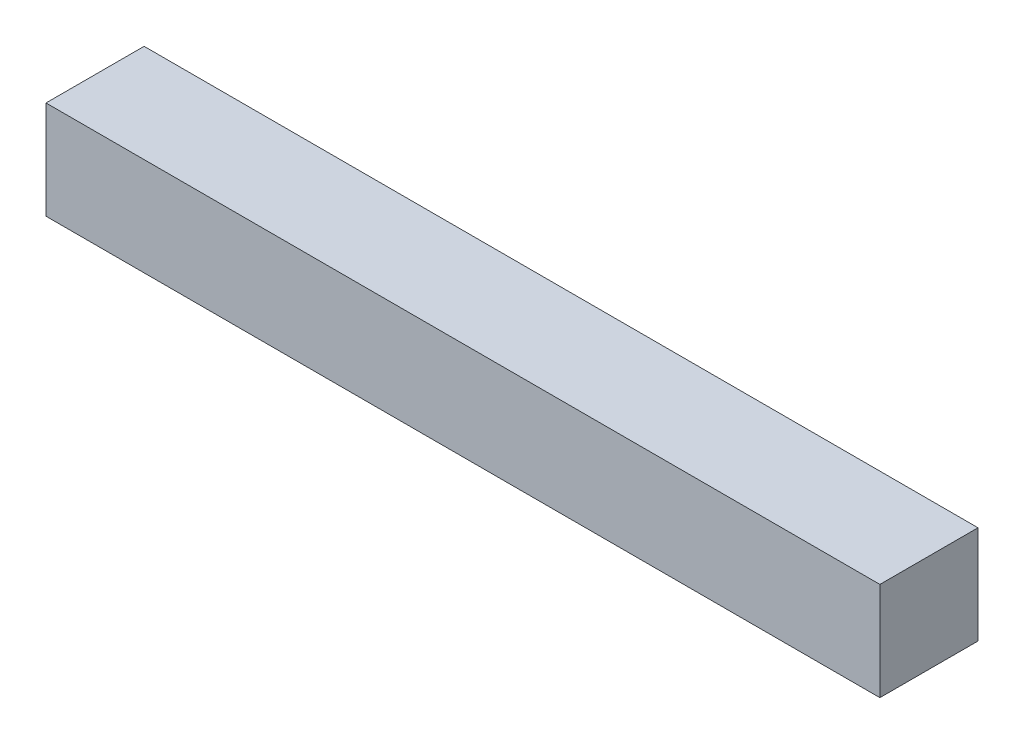
ISO-10303-21;
HEADER;
FILE_DESCRIPTION(('STEP AP214'),'2;1');
FILE_NAME('part.step','',(''),(''),'','','');
FILE_SCHEMA(('AUTOMOTIVE_DESIGN { 1 0 10303 214 1 1 1 1 }'));
ENDSEC;
DATA;
#1=APPLICATION_CONTEXT('core data for automotive mechanical design processes');
#2=APPLICATION_PROTOCOL_DEFINITION('international standard','automotive_design',2000,#1);
#3=PRODUCT_CONTEXT('',#1,'mechanical');
#4=PRODUCT('Part','Part','',(#3));
#5=PRODUCT_RELATED_PRODUCT_CATEGORY('part','',(#4));
#6=PRODUCT_DEFINITION_FORMATION('','',#4);
#7=PRODUCT_DEFINITION_CONTEXT('part definition',#1,'design');
#8=PRODUCT_DEFINITION('design','',#6,#7);
#9=PRODUCT_DEFINITION_SHAPE('','',#8);
#10=(LENGTH_UNIT() NAMED_UNIT(*) SI_UNIT(.MILLI.,.METRE.));
#11=(NAMED_UNIT(*) PLANE_ANGLE_UNIT() SI_UNIT($,.RADIAN.));
#12=(NAMED_UNIT(*) SI_UNIT($,.STERADIAN.) SOLID_ANGLE_UNIT());
#13=UNCERTAINTY_MEASURE_WITH_UNIT(LENGTH_MEASURE(1.E-05),#10,'distance_accuracy_value','');
#14=(GEOMETRIC_REPRESENTATION_CONTEXT(3) GLOBAL_UNCERTAINTY_ASSIGNED_CONTEXT((#13)) GLOBAL_UNIT_ASSIGNED_CONTEXT((#10,
#11,#12)) REPRESENTATION_CONTEXT('',''));
#15=CARTESIAN_POINT('',(0.,0.,0.));
#16=DIRECTION('',(0.,0.,1.));
#17=DIRECTION('',(1.,0.,0.));
#18=AXIS2_PLACEMENT_3D('',#15,#16,#17);
#19=CARTESIAN_POINT('',(849.999999999999,50.,-50.));
#20=DIRECTION('',(0.,0.,1.));
#21=DIRECTION('',(0.,-1.,0.));
#22=AXIS2_PLACEMENT_3D('',#19,#20,#21);
#23=PLANE('',#22);
#24=DIRECTION('',(0.,1.,0.));
#25=VECTOR('',#24,1.);
#26=CARTESIAN_POINT('',(0.,50.,-50.));
#27=LINE('',#26,#25);
#28=CARTESIAN_POINT('',(0.,-50.,-50.));
#29=VERTEX_POINT('',#28);
#30=CARTESIAN_POINT('',(0.,50.,-50.));
#31=VERTEX_POINT('',#30);
#32=EDGE_CURVE('E100',#29,#31,#27,.T.);
#33=ORIENTED_EDGE('',*,*,#32,.T.);
#34=DIRECTION('',(-1.,0.,0.));
#35=VECTOR('',#34,1.);
#36=CARTESIAN_POINT('',(849.999999999999,50.,-50.));
#37=LINE('',#36,#35);
#38=CARTESIAN_POINT('',(849.999999999999,50.,-50.));
#39=VERTEX_POINT('',#38);
#40=EDGE_CURVE('E11',#39,#31,#37,.T.);
#41=ORIENTED_EDGE('',*,*,#40,.F.);
#42=DIRECTION('',(0.,1.,0.));
#43=VECTOR('',#42,1.);
#44=CARTESIAN_POINT('',(849.999999999999,50.,-50.));
#45=LINE('',#44,#43);
#46=CARTESIAN_POINT('',(849.999999999999,-50.,-50.));
#47=VERTEX_POINT('',#46);
#48=EDGE_CURVE('E88',#47,#39,#45,.T.);
#49=ORIENTED_EDGE('',*,*,#48,.F.);
#50=DIRECTION('',(-1.,0.,0.));
#51=VECTOR('',#50,1.);
#52=CARTESIAN_POINT('',(849.999999999999,-50.,-50.));
#53=LINE('',#52,#51);
#54=EDGE_CURVE('E96',#47,#29,#53,.T.);
#55=ORIENTED_EDGE('',*,*,#54,.T.);
#56=EDGE_LOOP('',(#33,#41,#49,#55));
#57=FACE_BOUND('',#56,.T.);
#58=ADVANCED_FACE('F37',(#57),#23,.F.);
#59=CARTESIAN_POINT('',(849.999999999999,50.,50.));
#60=DIRECTION('',(0.,-1.,0.));
#61=DIRECTION('',(0.,0.,-1.));
#62=AXIS2_PLACEMENT_3D('',#59,#60,#61);
#63=PLANE('',#62);
#64=DIRECTION('',(0.,0.,1.));
#65=VECTOR('',#64,1.);
#66=CARTESIAN_POINT('',(0.,50.,50.));
#67=LINE('',#66,#65);
#68=CARTESIAN_POINT('',(0.,50.,50.));
#69=VERTEX_POINT('',#68);
#70=EDGE_CURVE('E92',#31,#69,#67,.T.);
#71=ORIENTED_EDGE('',*,*,#70,.T.);
#72=DIRECTION('',(-1.,0.,0.));
#73=VECTOR('',#72,1.);
#74=CARTESIAN_POINT('',(849.999999999999,50.,50.));
#75=LINE('',#74,#73);
#76=CARTESIAN_POINT('',(849.999999999999,50.,50.));
#77=VERTEX_POINT('',#76);
#78=EDGE_CURVE('E45',#77,#69,#75,.T.);
#79=ORIENTED_EDGE('',*,*,#78,.F.);
#80=DIRECTION('',(0.,0.,1.));
#81=VECTOR('',#80,1.);
#82=CARTESIAN_POINT('',(849.999999999999,50.,50.));
#83=LINE('',#82,#81);
#84=EDGE_CURVE('E83',#39,#77,#83,.T.);
#85=ORIENTED_EDGE('',*,*,#84,.F.);
#86=ORIENTED_EDGE('',*,*,#40,.T.);
#87=EDGE_LOOP('',(#71,#79,#85,#86));
#88=FACE_BOUND('',#87,.T.);
#89=ADVANCED_FACE('F91',(#88),#63,.F.);
#90=CARTESIAN_POINT('',(849.999999999999,50.,50.));
#91=DIRECTION('',(0.,0.,-1.));
#92=DIRECTION('',(-1.,0.,0.));
#93=AXIS2_PLACEMENT_3D('',#90,#91,#92);
#94=PLANE('',#93);
#95=DIRECTION('',(0.,-1.,0.));
#96=VECTOR('',#95,1.);
#97=CARTESIAN_POINT('',(0.,50.,50.));
#98=LINE('',#97,#96);
#99=CARTESIAN_POINT('',(0.,-50.,50.));
#100=VERTEX_POINT('',#99);
#101=EDGE_CURVE('E70',#69,#100,#98,.T.);
#102=ORIENTED_EDGE('',*,*,#101,.T.);
#103=DIRECTION('',(-1.,0.,0.));
#104=VECTOR('',#103,1.);
#105=CARTESIAN_POINT('',(849.999999999999,-50.,50.));
#106=LINE('',#105,#104);
#107=CARTESIAN_POINT('',(849.999999999999,-50.,50.));
#108=VERTEX_POINT('',#107);
#109=EDGE_CURVE('E93',#108,#100,#106,.T.);
#110=ORIENTED_EDGE('',*,*,#109,.F.);
#111=DIRECTION('',(0.,-1.,0.));
#112=VECTOR('',#111,1.);
#113=CARTESIAN_POINT('',(849.999999999999,50.,50.));
#114=LINE('',#113,#112);
#115=EDGE_CURVE('E86',#77,#108,#114,.T.);
#116=ORIENTED_EDGE('',*,*,#115,.F.);
#117=ORIENTED_EDGE('',*,*,#78,.T.);
#118=EDGE_LOOP('',(#102,#110,#116,#117));
#119=FACE_BOUND('',#118,.T.);
#120=ADVANCED_FACE('F94',(#119),#94,.F.);
#121=CARTESIAN_POINT('',(849.999999999999,-50.,50.));
#122=DIRECTION('',(0.,1.,0.));
#123=DIRECTION('',(0.,0.,1.));
#124=AXIS2_PLACEMENT_3D('',#121,#122,#123);
#125=PLANE('',#124);
#126=DIRECTION('',(0.,0.,-1.));
#127=VECTOR('',#126,1.);
#128=CARTESIAN_POINT('',(0.,-50.,50.));
#129=LINE('',#128,#127);
#130=EDGE_CURVE('E76',#100,#29,#129,.T.);
#131=ORIENTED_EDGE('',*,*,#130,.T.);
#132=ORIENTED_EDGE('',*,*,#54,.F.);
#133=DIRECTION('',(0.,0.,-1.));
#134=VECTOR('',#133,1.);
#135=CARTESIAN_POINT('',(849.999999999999,-50.,50.));
#136=LINE('',#135,#134);
#137=EDGE_CURVE('E53',#108,#47,#136,.T.);
#138=ORIENTED_EDGE('',*,*,#137,.F.);
#139=ORIENTED_EDGE('',*,*,#109,.T.);
#140=EDGE_LOOP('',(#131,#132,#138,#139));
#141=FACE_BOUND('',#140,.T.);
#142=ADVANCED_FACE('F107',(#141),#125,.F.);
#143=CARTESIAN_POINT('',(849.999999999999,0.,0.));
#144=DIRECTION('',(1.,0.,0.));
#145=DIRECTION('',(0.,0.,-1.));
#146=AXIS2_PLACEMENT_3D('',#143,#144,#145);
#147=PLANE('',#146);
#148=ORIENTED_EDGE('',*,*,#48,.T.);
#149=ORIENTED_EDGE('',*,*,#84,.T.);
#150=ORIENTED_EDGE('',*,*,#115,.T.);
#151=ORIENTED_EDGE('',*,*,#137,.T.);
#152=EDGE_LOOP('',(#148,#149,#150,#151));
#153=FACE_BOUND('',#152,.T.);
#154=ADVANCED_FACE('F84',(#153),#147,.T.);
#155=CARTESIAN_POINT('',(0.,0.,0.));
#156=DIRECTION('',(1.,0.,0.));
#157=DIRECTION('',(0.,0.,-1.));
#158=AXIS2_PLACEMENT_3D('',#155,#156,#157);
#159=PLANE('',#158);
#160=ORIENTED_EDGE('',*,*,#32,.F.);
#161=ORIENTED_EDGE('',*,*,#130,.F.);
#162=ORIENTED_EDGE('',*,*,#101,.F.);
#163=ORIENTED_EDGE('',*,*,#70,.F.);
#164=EDGE_LOOP('',(#160,#161,#162,#163));
#165=FACE_BOUND('',#164,.T.);
#166=ADVANCED_FACE('F110',(#165),#159,.F.);
#167=CLOSED_SHELL('',(#58,#89,#120,#142,#154,#166));
#168=MANIFOLD_SOLID_BREP('B2',#167);
#169=ADVANCED_BREP_SHAPE_REPRESENTATION('',(#18,#168),#14);
#170=SHAPE_DEFINITION_REPRESENTATION(#9,#169);
ENDSEC;
END-ISO-10303-21;
